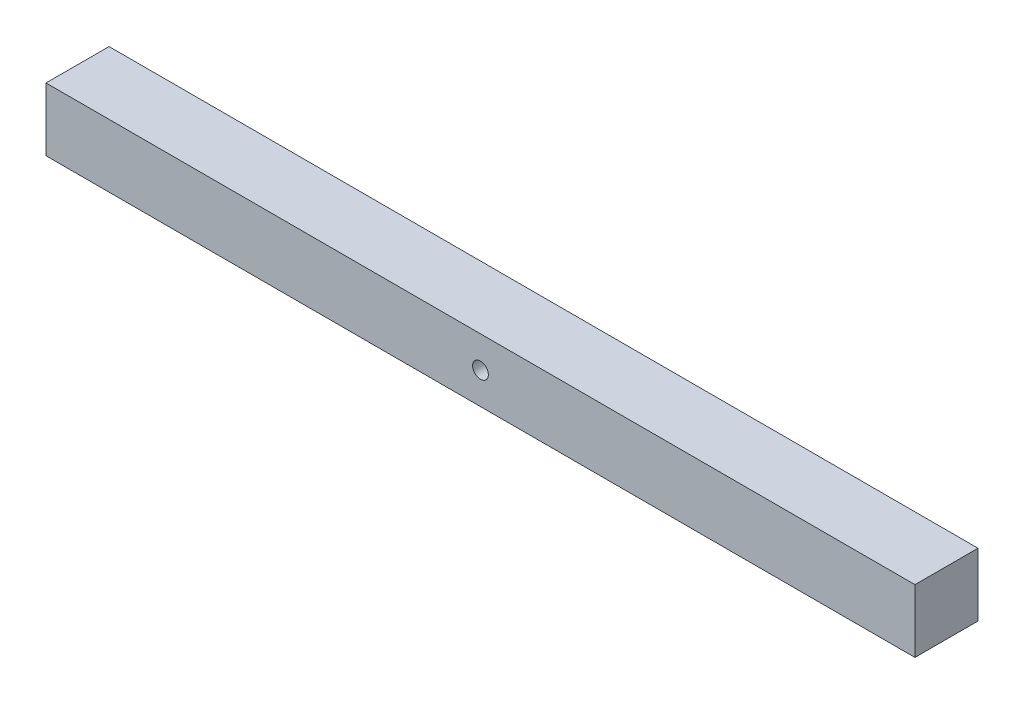
ISO-10303-21;
HEADER;
FILE_DESCRIPTION(('STEP AP214'),'2;1');
FILE_NAME('part.step','',(''),(''),'','','');
FILE_SCHEMA(('AUTOMOTIVE_DESIGN { 1 0 10303 214 1 1 1 1 }'));
ENDSEC;
DATA;
#1=APPLICATION_CONTEXT('core data for automotive mechanical design processes');
#2=APPLICATION_PROTOCOL_DEFINITION('international standard','automotive_design',2000,#1);
#3=PRODUCT_CONTEXT('',#1,'mechanical');
#4=PRODUCT('Part','Part','',(#3));
#5=PRODUCT_RELATED_PRODUCT_CATEGORY('part','',(#4));
#6=PRODUCT_DEFINITION_FORMATION('','',#4);
#7=PRODUCT_DEFINITION_CONTEXT('part definition',#1,'design');
#8=PRODUCT_DEFINITION('design','',#6,#7);
#9=PRODUCT_DEFINITION_SHAPE('','',#8);
#10=(LENGTH_UNIT() NAMED_UNIT(*) SI_UNIT(.MILLI.,.METRE.));
#11=(NAMED_UNIT(*) PLANE_ANGLE_UNIT() SI_UNIT($,.RADIAN.));
#12=(NAMED_UNIT(*) SI_UNIT($,.STERADIAN.) SOLID_ANGLE_UNIT());
#13=UNCERTAINTY_MEASURE_WITH_UNIT(LENGTH_MEASURE(1.E-05),#10,'distance_accuracy_value','');
#14=(GEOMETRIC_REPRESENTATION_CONTEXT(3) GLOBAL_UNCERTAINTY_ASSIGNED_CONTEXT((#13)) GLOBAL_UNIT_ASSIGNED_CONTEXT((#10,
#11,#12)) REPRESENTATION_CONTEXT('',''));
#15=CARTESIAN_POINT('',(0.,0.,0.));
#16=DIRECTION('',(0.,0.,1.));
#17=DIRECTION('',(1.,0.,0.));
#18=AXIS2_PLACEMENT_3D('',#15,#16,#17);
#19=CARTESIAN_POINT('',(0.,0.,50.8));
#20=DIRECTION('',(0.,0.,1.));
#21=DIRECTION('',(1.,0.,0.));
#22=AXIS2_PLACEMENT_3D('',#19,#20,#21);
#23=PLANE('',#22);
#24=DIRECTION('',(0.,-1.,0.));
#25=VECTOR('',#24,1.);
#26=CARTESIAN_POINT('',(-40.2874869312906,17.340856774481,50.8));
#27=LINE('',#26,#25);
#28=CARTESIAN_POINT('',(-40.2874869312906,17.340856774481,50.8));
#29=VERTEX_POINT('',#28);
#30=CARTESIAN_POINT('',(-40.2874869312906,-33.459143225519,50.8));
#31=VERTEX_POINT('',#30);
#32=EDGE_CURVE('E85',#29,#31,#27,.T.);
#33=ORIENTED_EDGE('',*,*,#32,.T.);
#34=DIRECTION('',(1.,0.,0.));
#35=VECTOR('',#34,1.);
#36=CARTESIAN_POINT('',(-40.2874869312906,-33.459143225519,50.8));
#37=LINE('',#36,#35);
#38=CARTESIAN_POINT('',(659.712513068709,-33.459143225519,50.8));
#39=VERTEX_POINT('',#38);
#40=EDGE_CURVE('E80',#31,#39,#37,.T.);
#41=ORIENTED_EDGE('',*,*,#40,.T.);
#42=DIRECTION('',(0.,1.,0.));
#43=VECTOR('',#42,1.);
#44=CARTESIAN_POINT('',(659.712513068709,17.340856774481,50.8));
#45=LINE('',#44,#43);
#46=CARTESIAN_POINT('',(659.712513068709,17.340856774481,50.8));
#47=VERTEX_POINT('',#46);
#48=EDGE_CURVE('E83',#39,#47,#45,.T.);
#49=ORIENTED_EDGE('',*,*,#48,.T.);
#50=DIRECTION('',(-1.,0.,0.));
#51=VECTOR('',#50,1.);
#52=CARTESIAN_POINT('',(-40.2874869312906,17.340856774481,50.8));
#53=LINE('',#52,#51);
#54=EDGE_CURVE('E50',#47,#29,#53,.T.);
#55=ORIENTED_EDGE('',*,*,#54,.T.);
#56=EDGE_LOOP('',(#33,#41,#49,#55));
#57=FACE_BOUND('',#56,.T.);
#58=CARTESIAN_POINT('',(309.712513068709,-8.059143225519,50.8));
#59=DIRECTION('',(0.,0.,1.));
#60=DIRECTION('',(1.,0.,0.));
#61=AXIS2_PLACEMENT_3D('',#58,#59,#60);
#62=CIRCLE('',#61,6.35);
#63=CARTESIAN_POINT('',(316.062513068709,-8.059143225519,50.8));
#64=VERTEX_POINT('',#63);
#65=EDGE_CURVE('E100',#64,#64,#62,.T.);
#66=ORIENTED_EDGE('',*,*,#65,.F.);
#67=EDGE_LOOP('',(#66));
#68=FACE_BOUND('',#67,.T.);
#69=ADVANCED_FACE('F33',(#57,#68),#23,.T.);
#70=CARTESIAN_POINT('',(0.,0.,0.));
#71=DIRECTION('',(0.,0.,1.));
#72=DIRECTION('',(1.,0.,0.));
#73=AXIS2_PLACEMENT_3D('',#70,#71,#72);
#74=PLANE('',#73);
#75=DIRECTION('',(0.,-1.,0.));
#76=VECTOR('',#75,1.);
#77=CARTESIAN_POINT('',(-40.2874869312906,17.340856774481,0.));
#78=LINE('',#77,#76);
#79=CARTESIAN_POINT('',(-40.2874869312906,17.340856774481,0.));
#80=VERTEX_POINT('',#79);
#81=CARTESIAN_POINT('',(-40.2874869312906,-33.459143225519,0.));
#82=VERTEX_POINT('',#81);
#83=EDGE_CURVE('E97',#80,#82,#78,.T.);
#84=ORIENTED_EDGE('',*,*,#83,.F.);
#85=DIRECTION('',(-1.,0.,0.));
#86=VECTOR('',#85,1.);
#87=CARTESIAN_POINT('',(-40.2874869312906,17.340856774481,0.));
#88=LINE('',#87,#86);
#89=CARTESIAN_POINT('',(659.712513068709,17.340856774481,0.));
#90=VERTEX_POINT('',#89);
#91=EDGE_CURVE('E73',#90,#80,#88,.T.);
#92=ORIENTED_EDGE('',*,*,#91,.F.);
#93=DIRECTION('',(0.,1.,0.));
#94=VECTOR('',#93,1.);
#95=CARTESIAN_POINT('',(659.712513068709,17.340856774481,0.));
#96=LINE('',#95,#94);
#97=CARTESIAN_POINT('',(659.712513068709,-33.459143225519,0.));
#98=VERTEX_POINT('',#97);
#99=EDGE_CURVE('E67',#98,#90,#96,.T.);
#100=ORIENTED_EDGE('',*,*,#99,.F.);
#101=DIRECTION('',(1.,0.,0.));
#102=VECTOR('',#101,1.);
#103=CARTESIAN_POINT('',(-40.2874869312906,-33.459143225519,0.));
#104=LINE('',#103,#102);
#105=EDGE_CURVE('E89',#82,#98,#104,.T.);
#106=ORIENTED_EDGE('',*,*,#105,.F.);
#107=EDGE_LOOP('',(#84,#92,#100,#106));
#108=FACE_BOUND('',#107,.T.);
#109=CARTESIAN_POINT('',(309.712513068709,-8.059143225519,0.));
#110=DIRECTION('',(0.,0.,1.));
#111=DIRECTION('',(1.,0.,0.));
#112=AXIS2_PLACEMENT_3D('',#109,#110,#111);
#113=CIRCLE('',#112,6.35);
#114=CARTESIAN_POINT('',(316.062513068709,-8.059143225519,0.));
#115=VERTEX_POINT('',#114);
#116=EDGE_CURVE('E112',#115,#115,#113,.T.);
#117=ORIENTED_EDGE('',*,*,#116,.T.);
#118=EDGE_LOOP('',(#117));
#119=FACE_BOUND('',#118,.T.);
#120=ADVANCED_FACE('F108',(#108,#119),#74,.F.);
#121=CARTESIAN_POINT('',(-40.2874869312906,17.340856774481,50.8));
#122=DIRECTION('',(1.,0.,0.));
#123=DIRECTION('',(0.,1.,0.));
#124=AXIS2_PLACEMENT_3D('',#121,#122,#123);
#125=PLANE('',#124);
#126=ORIENTED_EDGE('',*,*,#83,.T.);
#127=DIRECTION('',(0.,0.,-1.));
#128=VECTOR('',#127,1.);
#129=CARTESIAN_POINT('',(-40.2874869312906,-33.459143225519,50.8));
#130=LINE('',#129,#128);
#131=EDGE_CURVE('E11',#31,#82,#130,.T.);
#132=ORIENTED_EDGE('',*,*,#131,.F.);
#133=ORIENTED_EDGE('',*,*,#32,.F.);
#134=DIRECTION('',(0.,0.,-1.));
#135=VECTOR('',#134,1.);
#136=CARTESIAN_POINT('',(-40.2874869312906,17.340856774481,50.8));
#137=LINE('',#136,#135);
#138=EDGE_CURVE('E93',#29,#80,#137,.T.);
#139=ORIENTED_EDGE('',*,*,#138,.T.);
#140=EDGE_LOOP('',(#126,#132,#133,#139));
#141=FACE_BOUND('',#140,.T.);
#142=ADVANCED_FACE('F35',(#141),#125,.F.);
#143=CARTESIAN_POINT('',(-40.2874869312906,-33.459143225519,50.8));
#144=DIRECTION('',(0.,1.,0.));
#145=DIRECTION('',(0.,0.,1.));
#146=AXIS2_PLACEMENT_3D('',#143,#144,#145);
#147=PLANE('',#146);
#148=ORIENTED_EDGE('',*,*,#105,.T.);
#149=DIRECTION('',(0.,0.,-1.));
#150=VECTOR('',#149,1.);
#151=CARTESIAN_POINT('',(659.712513068709,-33.459143225519,50.8));
#152=LINE('',#151,#150);
#153=EDGE_CURVE('E42',#39,#98,#152,.T.);
#154=ORIENTED_EDGE('',*,*,#153,.F.);
#155=ORIENTED_EDGE('',*,*,#40,.F.);
#156=ORIENTED_EDGE('',*,*,#131,.T.);
#157=EDGE_LOOP('',(#148,#154,#155,#156));
#158=FACE_BOUND('',#157,.T.);
#159=ADVANCED_FACE('F88',(#158),#147,.F.);
#160=CARTESIAN_POINT('',(659.712513068709,17.340856774481,50.8));
#161=DIRECTION('',(-1.,0.,0.));
#162=DIRECTION('',(0.,0.,1.));
#163=AXIS2_PLACEMENT_3D('',#160,#161,#162);
#164=PLANE('',#163);
#165=ORIENTED_EDGE('',*,*,#99,.T.);
#166=DIRECTION('',(0.,0.,-1.));
#167=VECTOR('',#166,1.);
#168=CARTESIAN_POINT('',(659.712513068709,17.340856774481,50.8));
#169=LINE('',#168,#167);
#170=EDGE_CURVE('E90',#47,#90,#169,.T.);
#171=ORIENTED_EDGE('',*,*,#170,.F.);
#172=ORIENTED_EDGE('',*,*,#48,.F.);
#173=ORIENTED_EDGE('',*,*,#153,.T.);
#174=EDGE_LOOP('',(#165,#171,#172,#173));
#175=FACE_BOUND('',#174,.T.);
#176=ADVANCED_FACE('F91',(#175),#164,.F.);
#177=CARTESIAN_POINT('',(-40.2874869312906,17.340856774481,50.8));
#178=DIRECTION('',(0.,-1.,0.));
#179=DIRECTION('',(0.,0.,-1.));
#180=AXIS2_PLACEMENT_3D('',#177,#178,#179);
#181=PLANE('',#180);
#182=ORIENTED_EDGE('',*,*,#91,.T.);
#183=ORIENTED_EDGE('',*,*,#138,.F.);
#184=ORIENTED_EDGE('',*,*,#54,.F.);
#185=ORIENTED_EDGE('',*,*,#170,.T.);
#186=EDGE_LOOP('',(#182,#183,#184,#185));
#187=FACE_BOUND('',#186,.T.);
#188=ADVANCED_FACE('F105',(#187),#181,.F.);
#189=CARTESIAN_POINT('',(309.712513068709,-8.059143225519,50.8));
#190=DIRECTION('',(0.,0.,-1.));
#191=DIRECTION('',(-1.,0.,0.));
#192=AXIS2_PLACEMENT_3D('',#189,#190,#191);
#193=CYLINDRICAL_SURFACE('',#192,6.35);
#194=ORIENTED_EDGE('',*,*,#65,.T.);
#195=EDGE_LOOP('',(#194));
#196=FACE_BOUND('',#195,.T.);
#197=ORIENTED_EDGE('',*,*,#116,.F.);
#198=EDGE_LOOP('',(#197));
#199=FACE_BOUND('',#198,.T.);
#200=ADVANCED_FACE('F118',(#196,#199),#193,.F.);
#201=CLOSED_SHELL('',(#69,#120,#142,#159,#176,#188,#200));
#202=MANIFOLD_SOLID_BREP('B2',#201);
#203=ADVANCED_BREP_SHAPE_REPRESENTATION('',(#18,#202),#14);
#204=SHAPE_DEFINITION_REPRESENTATION(#9,#203);
ENDSEC;
END-ISO-10303-21;
